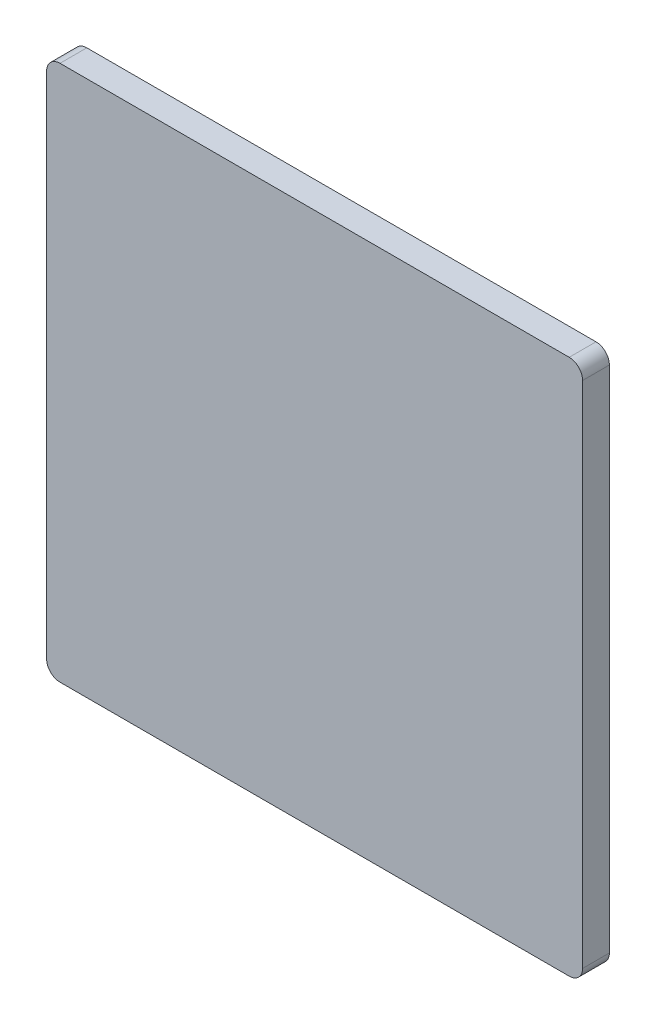
ISO-10303-21;
HEADER;
FILE_DESCRIPTION(('STEP AP214'),'2;1');
FILE_NAME('part.step','',(''),(''),'','','');
FILE_SCHEMA(('AUTOMOTIVE_DESIGN { 1 0 10303 214 1 1 1 1 }'));
ENDSEC;
DATA;
#1=APPLICATION_CONTEXT('core data for automotive mechanical design processes');
#2=APPLICATION_PROTOCOL_DEFINITION('international standard','automotive_design',2000,#1);
#3=PRODUCT_CONTEXT('',#1,'mechanical');
#4=PRODUCT('Part','Part','',(#3));
#5=PRODUCT_RELATED_PRODUCT_CATEGORY('part','',(#4));
#6=PRODUCT_DEFINITION_FORMATION('','',#4);
#7=PRODUCT_DEFINITION_CONTEXT('part definition',#1,'design');
#8=PRODUCT_DEFINITION('design','',#6,#7);
#9=PRODUCT_DEFINITION_SHAPE('','',#8);
#10=(LENGTH_UNIT() NAMED_UNIT(*) SI_UNIT(.MILLI.,.METRE.));
#11=(NAMED_UNIT(*) PLANE_ANGLE_UNIT() SI_UNIT($,.RADIAN.));
#12=(NAMED_UNIT(*) SI_UNIT($,.STERADIAN.) SOLID_ANGLE_UNIT());
#13=UNCERTAINTY_MEASURE_WITH_UNIT(LENGTH_MEASURE(1.E-05),#10,'distance_accuracy_value','');
#14=(GEOMETRIC_REPRESENTATION_CONTEXT(3) GLOBAL_UNCERTAINTY_ASSIGNED_CONTEXT((#13)) GLOBAL_UNIT_ASSIGNED_CONTEXT((#10,
#11,#12)) REPRESENTATION_CONTEXT('',''));
#15=CARTESIAN_POINT('',(0.,0.,0.));
#16=DIRECTION('',(0.,0.,1.));
#17=DIRECTION('',(1.,0.,0.));
#18=AXIS2_PLACEMENT_3D('',#15,#16,#17);
#19=CARTESIAN_POINT('',(0.,0.,3.15));
#20=DIRECTION('',(0.,0.,1.));
#21=DIRECTION('',(1.,0.,0.));
#22=AXIS2_PLACEMENT_3D('',#19,#20,#21);
#23=PLANE('',#22);
#24=DIRECTION('',(0.,1.,0.));
#25=VECTOR('',#24,1.);
#26=CARTESIAN_POINT('',(3.,0.,3.15));
#27=LINE('',#26,#25);
#28=CARTESIAN_POINT('',(3.,-2.85,3.15));
#29=VERTEX_POINT('',#28);
#30=CARTESIAN_POINT('',(3.,2.85,3.15));
#31=VERTEX_POINT('',#30);
#32=EDGE_CURVE('E101',#29,#31,#27,.T.);
#33=ORIENTED_EDGE('',*,*,#32,.F.);
#34=CARTESIAN_POINT('',(2.85,-2.85,3.15));
#35=DIRECTION('',(0.,0.,1.));
#36=DIRECTION('',(1.,0.,0.));
#37=AXIS2_PLACEMENT_3D('',#34,#35,#36);
#38=CIRCLE('',#37,0.15);
#39=CARTESIAN_POINT('',(2.85,-3.,3.15));
#40=VERTEX_POINT('',#39);
#41=EDGE_CURVE('E122',#40,#29,#38,.T.);
#42=ORIENTED_EDGE('',*,*,#41,.F.);
#43=DIRECTION('',(1.,0.,0.));
#44=VECTOR('',#43,1.);
#45=CARTESIAN_POINT('',(0.,-3.,3.15));
#46=LINE('',#45,#44);
#47=CARTESIAN_POINT('',(-2.85,-3.,3.15));
#48=VERTEX_POINT('',#47);
#49=EDGE_CURVE('E104',#48,#40,#46,.T.);
#50=ORIENTED_EDGE('',*,*,#49,.F.);
#51=CARTESIAN_POINT('',(-2.85,-2.85,3.15));
#52=DIRECTION('',(0.,0.,1.));
#53=DIRECTION('',(1.,0.,0.));
#54=AXIS2_PLACEMENT_3D('',#51,#52,#53);
#55=CIRCLE('',#54,0.15);
#56=CARTESIAN_POINT('',(-3.,-2.85,3.15));
#57=VERTEX_POINT('',#56);
#58=EDGE_CURVE('E124',#57,#48,#55,.T.);
#59=ORIENTED_EDGE('',*,*,#58,.F.);
#60=DIRECTION('',(0.,1.,0.));
#61=VECTOR('',#60,1.);
#62=CARTESIAN_POINT('',(-3.,0.,3.15));
#63=LINE('',#62,#61);
#64=CARTESIAN_POINT('',(-3.,2.85,3.15));
#65=VERTEX_POINT('',#64);
#66=EDGE_CURVE('E109',#65,#57,#63,.F.);
#67=ORIENTED_EDGE('',*,*,#66,.F.);
#68=CARTESIAN_POINT('',(-2.85,2.85,3.15));
#69=DIRECTION('',(0.,0.,1.));
#70=DIRECTION('',(1.,0.,0.));
#71=AXIS2_PLACEMENT_3D('',#68,#69,#70);
#72=CIRCLE('',#71,0.15);
#73=CARTESIAN_POINT('',(-2.85,3.,3.15));
#74=VERTEX_POINT('',#73);
#75=EDGE_CURVE('E89',#74,#65,#72,.T.);
#76=ORIENTED_EDGE('',*,*,#75,.F.);
#77=DIRECTION('',(1.,0.,0.));
#78=VECTOR('',#77,1.);
#79=CARTESIAN_POINT('',(0.,3.,3.15));
#80=LINE('',#79,#78);
#81=CARTESIAN_POINT('',(2.85,3.,3.15));
#82=VERTEX_POINT('',#81);
#83=EDGE_CURVE('E87',#82,#74,#80,.F.);
#84=ORIENTED_EDGE('',*,*,#83,.F.);
#85=CARTESIAN_POINT('',(2.85,2.85,3.15));
#86=DIRECTION('',(0.,0.,1.));
#87=DIRECTION('',(1.,0.,0.));
#88=AXIS2_PLACEMENT_3D('',#85,#86,#87);
#89=CIRCLE('',#88,0.15);
#90=EDGE_CURVE('E20',#31,#82,#89,.T.);
#91=ORIENTED_EDGE('',*,*,#90,.F.);
#92=EDGE_LOOP('',(#33,#42,#50,#59,#67,#76,#84,#91));
#93=FACE_BOUND('',#92,.T.);
#94=ADVANCED_FACE('F17',(#93),#23,.F.);
#95=CARTESIAN_POINT('',(0.,3.,3.15));
#96=DIRECTION('',(0.,1.,0.));
#97=DIRECTION('',(0.,0.,1.));
#98=AXIS2_PLACEMENT_3D('',#95,#96,#97);
#99=PLANE('',#98);
#100=DIRECTION('',(0.,0.,1.));
#101=VECTOR('',#100,1.);
#102=CARTESIAN_POINT('',(-2.85,3.,3.15));
#103=LINE('',#102,#101);
#104=CARTESIAN_POINT('',(-2.85,3.,3.45));
#105=VERTEX_POINT('',#104);
#106=EDGE_CURVE('E92',#105,#74,#103,.F.);
#107=ORIENTED_EDGE('',*,*,#106,.F.);
#108=DIRECTION('',(1.,0.,0.));
#109=VECTOR('',#108,1.);
#110=CARTESIAN_POINT('',(0.,3.,3.45));
#111=LINE('',#110,#109);
#112=CARTESIAN_POINT('',(2.85,3.,3.45));
#113=VERTEX_POINT('',#112);
#114=EDGE_CURVE('E96',#113,#105,#111,.F.);
#115=ORIENTED_EDGE('',*,*,#114,.F.);
#116=DIRECTION('',(0.,0.,1.));
#117=VECTOR('',#116,1.);
#118=CARTESIAN_POINT('',(2.85,3.,3.15));
#119=LINE('',#118,#117);
#120=EDGE_CURVE('E80',#113,#82,#119,.F.);
#121=ORIENTED_EDGE('',*,*,#120,.T.);
#122=ORIENTED_EDGE('',*,*,#83,.T.);
#123=EDGE_LOOP('',(#107,#115,#121,#122));
#124=FACE_BOUND('',#123,.T.);
#125=ADVANCED_FACE('F94',(#124),#99,.T.);
#126=CARTESIAN_POINT('',(-2.85,2.85,3.15));
#127=DIRECTION('',(0.,0.,1.));
#128=DIRECTION('',(1.,0.,0.));
#129=AXIS2_PLACEMENT_3D('',#126,#127,#128);
#130=CYLINDRICAL_SURFACE('',#129,0.15);
#131=DIRECTION('',(0.,0.,1.));
#132=VECTOR('',#131,1.);
#133=CARTESIAN_POINT('',(-3.,2.85,3.15));
#134=LINE('',#133,#132);
#135=CARTESIAN_POINT('',(-3.,2.85,3.45));
#136=VERTEX_POINT('',#135);
#137=EDGE_CURVE('E112',#136,#65,#134,.F.);
#138=ORIENTED_EDGE('',*,*,#137,.F.);
#139=CARTESIAN_POINT('',(-2.85,2.85,3.45));
#140=DIRECTION('',(0.,0.,1.));
#141=DIRECTION('',(1.,0.,0.));
#142=AXIS2_PLACEMENT_3D('',#139,#140,#141);
#143=CIRCLE('',#142,0.15);
#144=EDGE_CURVE('E119',#105,#136,#143,.T.);
#145=ORIENTED_EDGE('',*,*,#144,.F.);
#146=ORIENTED_EDGE('',*,*,#106,.T.);
#147=ORIENTED_EDGE('',*,*,#75,.T.);
#148=EDGE_LOOP('',(#138,#145,#146,#147));
#149=FACE_BOUND('',#148,.T.);
#150=ADVANCED_FACE('F129',(#149),#130,.T.);
#151=CARTESIAN_POINT('',(-3.,0.,3.15));
#152=DIRECTION('',(-1.,0.,0.));
#153=DIRECTION('',(0.,0.,1.));
#154=AXIS2_PLACEMENT_3D('',#151,#152,#153);
#155=PLANE('',#154);
#156=ORIENTED_EDGE('',*,*,#137,.T.);
#157=ORIENTED_EDGE('',*,*,#66,.T.);
#158=DIRECTION('',(0.,0.,1.));
#159=VECTOR('',#158,1.);
#160=CARTESIAN_POINT('',(-3.,-2.85,3.15));
#161=LINE('',#160,#159);
#162=CARTESIAN_POINT('',(-3.,-2.85,3.45));
#163=VERTEX_POINT('',#162);
#164=EDGE_CURVE('E111',#163,#57,#161,.F.);
#165=ORIENTED_EDGE('',*,*,#164,.F.);
#166=DIRECTION('',(0.,1.,0.));
#167=VECTOR('',#166,1.);
#168=CARTESIAN_POINT('',(-3.,0.,3.45));
#169=LINE('',#168,#167);
#170=EDGE_CURVE('E118',#136,#163,#169,.F.);
#171=ORIENTED_EDGE('',*,*,#170,.F.);
#172=EDGE_LOOP('',(#156,#157,#165,#171));
#173=FACE_BOUND('',#172,.T.);
#174=ADVANCED_FACE('F152',(#173),#155,.T.);
#175=CARTESIAN_POINT('',(-2.85,-2.85,3.15));
#176=DIRECTION('',(0.,0.,1.));
#177=DIRECTION('',(1.,0.,0.));
#178=AXIS2_PLACEMENT_3D('',#175,#176,#177);
#179=CYLINDRICAL_SURFACE('',#178,0.15);
#180=DIRECTION('',(0.,0.,-1.));
#181=VECTOR('',#180,1.);
#182=CARTESIAN_POINT('',(-2.85,-3.,3.15));
#183=LINE('',#182,#181);
#184=CARTESIAN_POINT('',(-2.85,-3.,3.45));
#185=VERTEX_POINT('',#184);
#186=EDGE_CURVE('E108',#185,#48,#183,.T.);
#187=ORIENTED_EDGE('',*,*,#186,.F.);
#188=CARTESIAN_POINT('',(-2.85,-2.85,3.45));
#189=DIRECTION('',(0.,0.,1.));
#190=DIRECTION('',(1.,0.,0.));
#191=AXIS2_PLACEMENT_3D('',#188,#189,#190);
#192=CIRCLE('',#191,0.15);
#193=EDGE_CURVE('E116',#163,#185,#192,.T.);
#194=ORIENTED_EDGE('',*,*,#193,.F.);
#195=ORIENTED_EDGE('',*,*,#164,.T.);
#196=ORIENTED_EDGE('',*,*,#58,.T.);
#197=EDGE_LOOP('',(#187,#194,#195,#196));
#198=FACE_BOUND('',#197,.T.);
#199=ADVANCED_FACE('F149',(#198),#179,.T.);
#200=CARTESIAN_POINT('',(0.,-3.,3.15));
#201=DIRECTION('',(0.,-1.,0.));
#202=DIRECTION('',(0.,0.,-1.));
#203=AXIS2_PLACEMENT_3D('',#200,#201,#202);
#204=PLANE('',#203);
#205=DIRECTION('',(0.,0.,1.));
#206=VECTOR('',#205,1.);
#207=CARTESIAN_POINT('',(2.85,-3.,3.15));
#208=LINE('',#207,#206);
#209=CARTESIAN_POINT('',(2.85,-3.,3.45));
#210=VERTEX_POINT('',#209);
#211=EDGE_CURVE('E107',#210,#40,#208,.F.);
#212=ORIENTED_EDGE('',*,*,#211,.F.);
#213=DIRECTION('',(1.,0.,0.));
#214=VECTOR('',#213,1.);
#215=CARTESIAN_POINT('',(0.,-3.,3.45));
#216=LINE('',#215,#214);
#217=EDGE_CURVE('E115',#185,#210,#216,.T.);
#218=ORIENTED_EDGE('',*,*,#217,.F.);
#219=ORIENTED_EDGE('',*,*,#186,.T.);
#220=ORIENTED_EDGE('',*,*,#49,.T.);
#221=EDGE_LOOP('',(#212,#218,#219,#220));
#222=FACE_BOUND('',#221,.T.);
#223=ADVANCED_FACE('F155',(#222),#204,.T.);
#224=CARTESIAN_POINT('',(2.85,-2.85,3.15));
#225=DIRECTION('',(0.,0.,1.));
#226=DIRECTION('',(1.,0.,0.));
#227=AXIS2_PLACEMENT_3D('',#224,#225,#226);
#228=CYLINDRICAL_SURFACE('',#227,0.15);
#229=DIRECTION('',(0.,0.,-1.));
#230=VECTOR('',#229,1.);
#231=CARTESIAN_POINT('',(3.,-2.85,3.15));
#232=LINE('',#231,#230);
#233=CARTESIAN_POINT('',(3.,-2.85,3.45));
#234=VERTEX_POINT('',#233);
#235=EDGE_CURVE('E103',#234,#29,#232,.T.);
#236=ORIENTED_EDGE('',*,*,#235,.F.);
#237=CARTESIAN_POINT('',(2.85,-2.85,3.45));
#238=DIRECTION('',(0.,0.,1.));
#239=DIRECTION('',(1.,0.,0.));
#240=AXIS2_PLACEMENT_3D('',#237,#238,#239);
#241=CIRCLE('',#240,0.15);
#242=EDGE_CURVE('E26',#210,#234,#241,.T.);
#243=ORIENTED_EDGE('',*,*,#242,.F.);
#244=ORIENTED_EDGE('',*,*,#211,.T.);
#245=ORIENTED_EDGE('',*,*,#41,.T.);
#246=EDGE_LOOP('',(#236,#243,#244,#245));
#247=FACE_BOUND('',#246,.T.);
#248=ADVANCED_FACE('F161',(#247),#228,.T.);
#249=CARTESIAN_POINT('',(3.,0.,3.15));
#250=DIRECTION('',(1.,0.,0.));
#251=DIRECTION('',(0.,0.,-1.));
#252=AXIS2_PLACEMENT_3D('',#249,#250,#251);
#253=PLANE('',#252);
#254=ORIENTED_EDGE('',*,*,#235,.T.);
#255=ORIENTED_EDGE('',*,*,#32,.T.);
#256=DIRECTION('',(0.,0.,1.));
#257=VECTOR('',#256,1.);
#258=CARTESIAN_POINT('',(3.,2.85,3.15));
#259=LINE('',#258,#257);
#260=CARTESIAN_POINT('',(3.,2.85,3.45));
#261=VERTEX_POINT('',#260);
#262=EDGE_CURVE('E82',#261,#31,#259,.F.);
#263=ORIENTED_EDGE('',*,*,#262,.F.);
#264=DIRECTION('',(0.,1.,0.));
#265=VECTOR('',#264,1.);
#266=CARTESIAN_POINT('',(3.,0.,3.45));
#267=LINE('',#266,#265);
#268=EDGE_CURVE('E11',#234,#261,#267,.T.);
#269=ORIENTED_EDGE('',*,*,#268,.F.);
#270=EDGE_LOOP('',(#254,#255,#263,#269));
#271=FACE_BOUND('',#270,.T.);
#272=ADVANCED_FACE('F163',(#271),#253,.T.);
#273=CARTESIAN_POINT('',(2.85,2.85,3.15));
#274=DIRECTION('',(0.,0.,1.));
#275=DIRECTION('',(1.,0.,0.));
#276=AXIS2_PLACEMENT_3D('',#273,#274,#275);
#277=CYLINDRICAL_SURFACE('',#276,0.15);
#278=ORIENTED_EDGE('',*,*,#262,.T.);
#279=ORIENTED_EDGE('',*,*,#90,.T.);
#280=ORIENTED_EDGE('',*,*,#120,.F.);
#281=CARTESIAN_POINT('',(2.85,2.85,3.45));
#282=DIRECTION('',(0.,0.,1.));
#283=DIRECTION('',(1.,0.,0.));
#284=AXIS2_PLACEMENT_3D('',#281,#282,#283);
#285=CIRCLE('',#284,0.15);
#286=EDGE_CURVE('E35',#261,#113,#285,.T.);
#287=ORIENTED_EDGE('',*,*,#286,.F.);
#288=EDGE_LOOP('',(#278,#279,#280,#287));
#289=FACE_BOUND('',#288,.T.);
#290=ADVANCED_FACE('F78',(#289),#277,.T.);
#291=CARTESIAN_POINT('',(0.,0.,3.45));
#292=DIRECTION('',(0.,0.,1.));
#293=DIRECTION('',(1.,0.,0.));
#294=AXIS2_PLACEMENT_3D('',#291,#292,#293);
#295=PLANE('',#294);
#296=ORIENTED_EDGE('',*,*,#268,.T.);
#297=ORIENTED_EDGE('',*,*,#286,.T.);
#298=ORIENTED_EDGE('',*,*,#114,.T.);
#299=ORIENTED_EDGE('',*,*,#144,.T.);
#300=ORIENTED_EDGE('',*,*,#170,.T.);
#301=ORIENTED_EDGE('',*,*,#193,.T.);
#302=ORIENTED_EDGE('',*,*,#217,.T.);
#303=ORIENTED_EDGE('',*,*,#242,.T.);
#304=EDGE_LOOP('',(#296,#297,#298,#299,#300,#301,#302,#303));
#305=FACE_BOUND('',#304,.T.);
#306=ADVANCED_FACE('F133',(#305),#295,.T.);
#307=CLOSED_SHELL('',(#94,#125,#150,#174,#199,#223,#248,#272,#290,#306));
#308=MANIFOLD_SOLID_BREP('B1',#307);
#309=ADVANCED_BREP_SHAPE_REPRESENTATION('',(#18,#308),#14);
#310=SHAPE_DEFINITION_REPRESENTATION(#9,#309);
ENDSEC;
END-ISO-10303-21;
